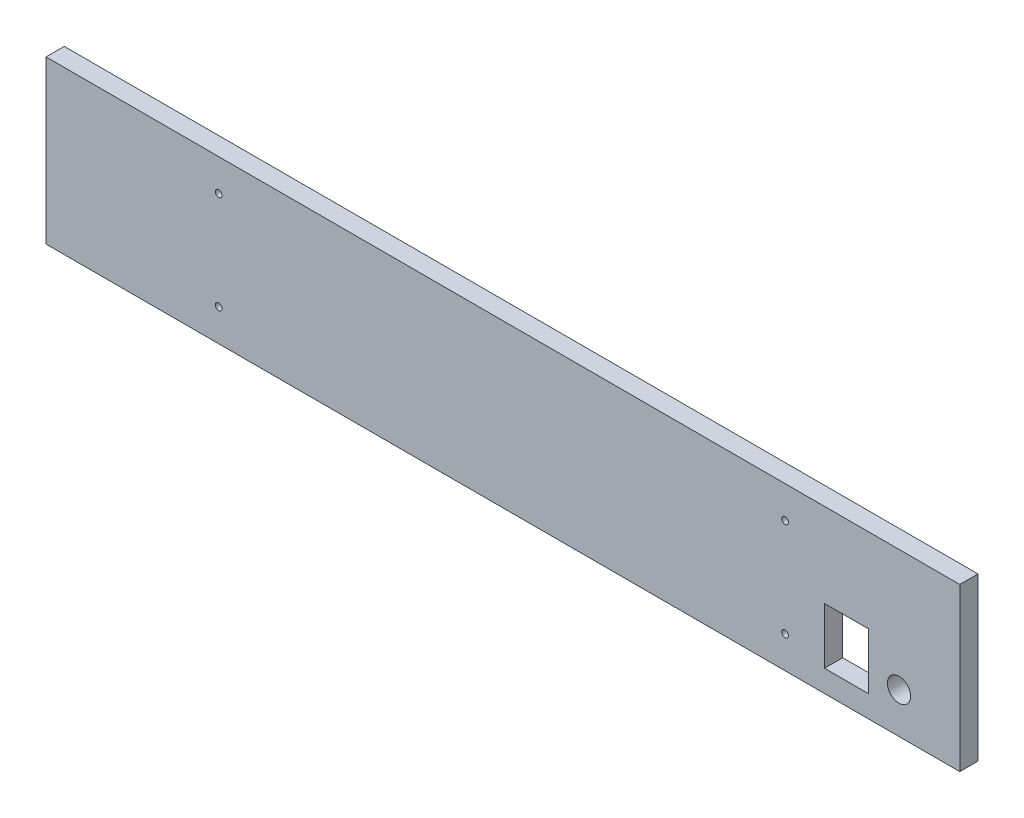
ISO-10303-21;
HEADER;
FILE_DESCRIPTION(('STEP AP214'),'2;1');
FILE_NAME('part.step','',(''),(''),'','','');
FILE_SCHEMA(('AUTOMOTIVE_DESIGN { 1 0 10303 214 1 1 1 1 }'));
ENDSEC;
DATA;
#1=APPLICATION_CONTEXT('core data for automotive mechanical design processes');
#2=APPLICATION_PROTOCOL_DEFINITION('international standard','automotive_design',2000,#1);
#3=PRODUCT_CONTEXT('',#1,'mechanical');
#4=PRODUCT('Part','Part','',(#3));
#5=PRODUCT_RELATED_PRODUCT_CATEGORY('part','',(#4));
#6=PRODUCT_DEFINITION_FORMATION('','',#4);
#7=PRODUCT_DEFINITION_CONTEXT('part definition',#1,'design');
#8=PRODUCT_DEFINITION('design','',#6,#7);
#9=PRODUCT_DEFINITION_SHAPE('','',#8);
#10=(LENGTH_UNIT() NAMED_UNIT(*) SI_UNIT(.MILLI.,.METRE.));
#11=(NAMED_UNIT(*) PLANE_ANGLE_UNIT() SI_UNIT($,.RADIAN.));
#12=(NAMED_UNIT(*) SI_UNIT($,.STERADIAN.) SOLID_ANGLE_UNIT());
#13=UNCERTAINTY_MEASURE_WITH_UNIT(LENGTH_MEASURE(1.E-05),#10,'distance_accuracy_value','');
#14=(GEOMETRIC_REPRESENTATION_CONTEXT(3) GLOBAL_UNCERTAINTY_ASSIGNED_CONTEXT((#13)) GLOBAL_UNIT_ASSIGNED_CONTEXT((#10,
#11,#12)) REPRESENTATION_CONTEXT('',''));
#15=CARTESIAN_POINT('',(0.,0.,0.));
#16=DIRECTION('',(0.,0.,1.));
#17=DIRECTION('',(1.,0.,0.));
#18=AXIS2_PLACEMENT_3D('',#15,#16,#17);
#19=CARTESIAN_POINT('',(0.,0.,-9.));
#20=DIRECTION('',(0.,0.,-1.));
#21=DIRECTION('',(-1.,0.,0.));
#22=AXIS2_PLACEMENT_3D('',#19,#20,#21);
#23=PLANE('',#22);
#24=CARTESIAN_POINT('',(85.22,15.79,-9.));
#25=DIRECTION('',(0.,0.,-1.));
#26=DIRECTION('',(-1.,0.,0.));
#27=AXIS2_PLACEMENT_3D('',#24,#25,#26);
#28=CIRCLE('',#27,1.65000000000002);
#29=CARTESIAN_POINT('',(83.57,15.79,-9.));
#30=VERTEX_POINT('',#29);
#31=EDGE_CURVE('E229',#30,#30,#28,.T.);
#32=ORIENTED_EDGE('',*,*,#31,.F.);
#33=EDGE_LOOP('',(#32));
#34=FACE_BOUND('',#33,.T.);
#35=CARTESIAN_POINT('',(85.22,64.21,-9.));
#36=DIRECTION('',(0.,0.,-1.));
#37=DIRECTION('',(-1.,0.,0.));
#38=AXIS2_PLACEMENT_3D('',#35,#36,#37);
#39=CIRCLE('',#38,1.65000000000002);
#40=CARTESIAN_POINT('',(83.57,64.21,-9.));
#41=VERTEX_POINT('',#40);
#42=EDGE_CURVE('E239',#41,#41,#39,.T.);
#43=ORIENTED_EDGE('',*,*,#42,.F.);
#44=EDGE_LOOP('',(#43));
#45=FACE_BOUND('',#44,.T.);
#46=CARTESIAN_POINT('',(364.78,15.79,-9.));
#47=DIRECTION('',(0.,0.,-1.));
#48=DIRECTION('',(-1.,0.,0.));
#49=AXIS2_PLACEMENT_3D('',#46,#47,#48);
#50=CIRCLE('',#49,1.64999999999999);
#51=CARTESIAN_POINT('',(363.13,15.79,-9.));
#52=VERTEX_POINT('',#51);
#53=EDGE_CURVE('E245',#52,#52,#50,.T.);
#54=ORIENTED_EDGE('',*,*,#53,.F.);
#55=EDGE_LOOP('',(#54));
#56=FACE_BOUND('',#55,.T.);
#57=CARTESIAN_POINT('',(364.78,64.21,-9.));
#58=DIRECTION('',(0.,0.,-1.));
#59=DIRECTION('',(-1.,0.,0.));
#60=AXIS2_PLACEMENT_3D('',#57,#58,#59);
#61=CIRCLE('',#60,1.64999999999999);
#62=CARTESIAN_POINT('',(363.13,64.21,-9.));
#63=VERTEX_POINT('',#62);
#64=EDGE_CURVE('E251',#63,#63,#61,.T.);
#65=ORIENTED_EDGE('',*,*,#64,.F.);
#66=EDGE_LOOP('',(#65));
#67=FACE_BOUND('',#66,.T.);
#68=CARTESIAN_POINT('',(421.,20.,-9.));
#69=DIRECTION('',(0.,0.,-1.));
#70=DIRECTION('',(-1.,0.,0.));
#71=AXIS2_PLACEMENT_3D('',#68,#69,#70);
#72=CIRCLE('',#71,5.74999999999998);
#73=CARTESIAN_POINT('',(415.25,20.,-9.));
#74=VERTEX_POINT('',#73);
#75=EDGE_CURVE('E257',#74,#74,#72,.T.);
#76=ORIENTED_EDGE('',*,*,#75,.F.);
#77=EDGE_LOOP('',(#76));
#78=FACE_BOUND('',#77,.T.);
#79=DIRECTION('',(0.,-1.,0.));
#80=VECTOR('',#79,1.);
#81=CARTESIAN_POINT('',(0.,0.,-9.));
#82=LINE('',#81,#80);
#83=CARTESIAN_POINT('',(0.,80.,-9.));
#84=VERTEX_POINT('',#83);
#85=CARTESIAN_POINT('',(0.,0.,-9.));
#86=VERTEX_POINT('',#85);
#87=EDGE_CURVE('E135',#84,#86,#82,.T.);
#88=ORIENTED_EDGE('',*,*,#87,.F.);
#89=DIRECTION('',(-1.,0.,0.));
#90=VECTOR('',#89,1.);
#91=CARTESIAN_POINT('',(0.,80.,-9.));
#92=LINE('',#91,#90);
#93=CARTESIAN_POINT('',(451.,80.,-9.));
#94=VERTEX_POINT('',#93);
#95=EDGE_CURVE('E145',#94,#84,#92,.T.);
#96=ORIENTED_EDGE('',*,*,#95,.F.);
#97=DIRECTION('',(0.,1.,0.));
#98=VECTOR('',#97,1.);
#99=CARTESIAN_POINT('',(451.,0.,-9.));
#100=LINE('',#99,#98);
#101=CARTESIAN_POINT('',(451.,0.,-9.));
#102=VERTEX_POINT('',#101);
#103=EDGE_CURVE('E142',#102,#94,#100,.T.);
#104=ORIENTED_EDGE('',*,*,#103,.F.);
#105=DIRECTION('',(1.,0.,0.));
#106=VECTOR('',#105,1.);
#107=CARTESIAN_POINT('',(0.,0.,-9.));
#108=LINE('',#107,#106);
#109=EDGE_CURVE('E138',#86,#102,#108,.T.);
#110=ORIENTED_EDGE('',*,*,#109,.F.);
#111=EDGE_LOOP('',(#88,#96,#104,#110));
#112=FACE_BOUND('',#111,.T.);
#113=DIRECTION('',(1.,0.,0.));
#114=VECTOR('',#113,1.);
#115=CARTESIAN_POINT('',(0.,38.49,-9.));
#116=LINE('',#115,#114);
#117=CARTESIAN_POINT('',(384.2,38.49,-9.));
#118=VERTEX_POINT('',#117);
#119=CARTESIAN_POINT('',(406.,38.49,-9.));
#120=VERTEX_POINT('',#119);
#121=EDGE_CURVE('E129',#118,#120,#116,.T.);
#122=ORIENTED_EDGE('',*,*,#121,.F.);
#123=DIRECTION('',(0.,-1.,0.));
#124=VECTOR('',#123,1.);
#125=CARTESIAN_POINT('',(384.2,0.,-9.));
#126=LINE('',#125,#124);
#127=CARTESIAN_POINT('',(384.2,10.79,-9.));
#128=VERTEX_POINT('',#127);
#129=EDGE_CURVE('E131',#118,#128,#126,.T.);
#130=ORIENTED_EDGE('',*,*,#129,.T.);
#131=DIRECTION('',(1.,0.,0.));
#132=VECTOR('',#131,1.);
#133=CARTESIAN_POINT('',(0.,10.79,-9.));
#134=LINE('',#133,#132);
#135=CARTESIAN_POINT('',(406.,10.79,-9.));
#136=VERTEX_POINT('',#135);
#137=EDGE_CURVE('E124',#128,#136,#134,.T.);
#138=ORIENTED_EDGE('',*,*,#137,.T.);
#139=DIRECTION('',(0.,-1.,0.));
#140=VECTOR('',#139,1.);
#141=CARTESIAN_POINT('',(406.,0.,-9.));
#142=LINE('',#141,#140);
#143=EDGE_CURVE('E105',#120,#136,#142,.T.);
#144=ORIENTED_EDGE('',*,*,#143,.F.);
#145=EDGE_LOOP('',(#122,#130,#138,#144));
#146=FACE_BOUND('',#145,.T.);
#147=ADVANCED_FACE('F33',(#34,#45,#56,#67,#78,#112,#146),#23,.T.);
#148=CARTESIAN_POINT('',(0.,0.,0.));
#149=DIRECTION('',(0.,0.,-1.));
#150=DIRECTION('',(-1.,0.,0.));
#151=AXIS2_PLACEMENT_3D('',#148,#149,#150);
#152=PLANE('',#151);
#153=CARTESIAN_POINT('',(85.22,15.79,0.));
#154=DIRECTION('',(0.,0.,1.));
#155=DIRECTION('',(1.,0.,0.));
#156=AXIS2_PLACEMENT_3D('',#153,#154,#155);
#157=CIRCLE('',#156,1.65000000000002);
#158=CARTESIAN_POINT('',(86.87,15.79,0.));
#159=VERTEX_POINT('',#158);
#160=EDGE_CURVE('E232',#159,#159,#157,.T.);
#161=ORIENTED_EDGE('',*,*,#160,.F.);
#162=EDGE_LOOP('',(#161));
#163=FACE_BOUND('',#162,.T.);
#164=CARTESIAN_POINT('',(85.22,64.21,0.));
#165=DIRECTION('',(0.,0.,1.));
#166=DIRECTION('',(1.,0.,0.));
#167=AXIS2_PLACEMENT_3D('',#164,#165,#166);
#168=CIRCLE('',#167,1.65000000000002);
#169=CARTESIAN_POINT('',(86.87,64.21,0.));
#170=VERTEX_POINT('',#169);
#171=EDGE_CURVE('E234',#170,#170,#168,.T.);
#172=ORIENTED_EDGE('',*,*,#171,.F.);
#173=EDGE_LOOP('',(#172));
#174=FACE_BOUND('',#173,.T.);
#175=CARTESIAN_POINT('',(364.78,15.79,0.));
#176=DIRECTION('',(0.,0.,1.));
#177=DIRECTION('',(1.,0.,0.));
#178=AXIS2_PLACEMENT_3D('',#175,#176,#177);
#179=CIRCLE('',#178,1.64999999999999);
#180=CARTESIAN_POINT('',(366.43,15.79,0.));
#181=VERTEX_POINT('',#180);
#182=EDGE_CURVE('E242',#181,#181,#179,.T.);
#183=ORIENTED_EDGE('',*,*,#182,.F.);
#184=EDGE_LOOP('',(#183));
#185=FACE_BOUND('',#184,.T.);
#186=CARTESIAN_POINT('',(364.78,64.21,0.));
#187=DIRECTION('',(0.,0.,1.));
#188=DIRECTION('',(1.,0.,0.));
#189=AXIS2_PLACEMENT_3D('',#186,#187,#188);
#190=CIRCLE('',#189,1.64999999999999);
#191=CARTESIAN_POINT('',(366.43,64.21,0.));
#192=VERTEX_POINT('',#191);
#193=EDGE_CURVE('E248',#192,#192,#190,.T.);
#194=ORIENTED_EDGE('',*,*,#193,.F.);
#195=EDGE_LOOP('',(#194));
#196=FACE_BOUND('',#195,.T.);
#197=CARTESIAN_POINT('',(421.,20.,0.));
#198=DIRECTION('',(0.,0.,1.));
#199=DIRECTION('',(1.,0.,0.));
#200=AXIS2_PLACEMENT_3D('',#197,#198,#199);
#201=CIRCLE('',#200,5.74999999999998);
#202=CARTESIAN_POINT('',(426.75,20.,0.));
#203=VERTEX_POINT('',#202);
#204=EDGE_CURVE('E254',#203,#203,#201,.T.);
#205=ORIENTED_EDGE('',*,*,#204,.F.);
#206=EDGE_LOOP('',(#205));
#207=FACE_BOUND('',#206,.T.);
#208=DIRECTION('',(0.,-1.,0.));
#209=VECTOR('',#208,1.);
#210=CARTESIAN_POINT('',(0.,0.,0.));
#211=LINE('',#210,#209);
#212=CARTESIAN_POINT('',(0.,80.,0.));
#213=VERTEX_POINT('',#212);
#214=CARTESIAN_POINT('',(0.,0.,0.));
#215=VERTEX_POINT('',#214);
#216=EDGE_CURVE('E134',#213,#215,#211,.T.);
#217=ORIENTED_EDGE('',*,*,#216,.T.);
#218=DIRECTION('',(1.,0.,0.));
#219=VECTOR('',#218,1.);
#220=CARTESIAN_POINT('',(0.,0.,0.));
#221=LINE('',#220,#219);
#222=CARTESIAN_POINT('',(451.,0.,0.));
#223=VERTEX_POINT('',#222);
#224=EDGE_CURVE('E150',#215,#223,#221,.T.);
#225=ORIENTED_EDGE('',*,*,#224,.T.);
#226=DIRECTION('',(0.,1.,0.));
#227=VECTOR('',#226,1.);
#228=CARTESIAN_POINT('',(451.,0.,0.));
#229=LINE('',#228,#227);
#230=CARTESIAN_POINT('',(451.,80.,0.));
#231=VERTEX_POINT('',#230);
#232=EDGE_CURVE('E153',#223,#231,#229,.T.);
#233=ORIENTED_EDGE('',*,*,#232,.T.);
#234=DIRECTION('',(-1.,0.,0.));
#235=VECTOR('',#234,1.);
#236=CARTESIAN_POINT('',(0.,80.,0.));
#237=LINE('',#236,#235);
#238=EDGE_CURVE('E139',#231,#213,#237,.T.);
#239=ORIENTED_EDGE('',*,*,#238,.T.);
#240=EDGE_LOOP('',(#217,#225,#233,#239));
#241=FACE_BOUND('',#240,.T.);
#242=DIRECTION('',(0.,1.,0.));
#243=VECTOR('',#242,1.);
#244=CARTESIAN_POINT('',(384.2,0.,0.));
#245=LINE('',#244,#243);
#246=CARTESIAN_POINT('',(384.2,10.79,0.));
#247=VERTEX_POINT('',#246);
#248=CARTESIAN_POINT('',(384.2,38.49,0.));
#249=VERTEX_POINT('',#248);
#250=EDGE_CURVE('E58',#247,#249,#245,.T.);
#251=ORIENTED_EDGE('',*,*,#250,.T.);
#252=DIRECTION('',(-1.,0.,0.));
#253=VECTOR('',#252,1.);
#254=CARTESIAN_POINT('',(0.,38.49,0.));
#255=LINE('',#254,#253);
#256=CARTESIAN_POINT('',(406.,38.49,0.));
#257=VERTEX_POINT('',#256);
#258=EDGE_CURVE('E117',#257,#249,#255,.T.);
#259=ORIENTED_EDGE('',*,*,#258,.F.);
#260=DIRECTION('',(0.,1.,0.));
#261=VECTOR('',#260,1.);
#262=CARTESIAN_POINT('',(406.,0.,0.));
#263=LINE('',#262,#261);
#264=CARTESIAN_POINT('',(406.,10.79,0.));
#265=VERTEX_POINT('',#264);
#266=EDGE_CURVE('E102',#265,#257,#263,.T.);
#267=ORIENTED_EDGE('',*,*,#266,.F.);
#268=DIRECTION('',(-1.,0.,0.));
#269=VECTOR('',#268,1.);
#270=CARTESIAN_POINT('',(0.,10.79,0.));
#271=LINE('',#270,#269);
#272=EDGE_CURVE('E111',#265,#247,#271,.T.);
#273=ORIENTED_EDGE('',*,*,#272,.T.);
#274=EDGE_LOOP('',(#251,#259,#267,#273));
#275=FACE_BOUND('',#274,.T.);
#276=ADVANCED_FACE('F115',(#163,#174,#185,#196,#207,#241,#275),#152,.F.);
#277=CARTESIAN_POINT('',(0.,0.,-9.));
#278=DIRECTION('',(-1.,0.,0.));
#279=DIRECTION('',(0.,0.,1.));
#280=AXIS2_PLACEMENT_3D('',#277,#278,#279);
#281=PLANE('',#280);
#282=ORIENTED_EDGE('',*,*,#216,.F.);
#283=DIRECTION('',(0.,0.,1.));
#284=VECTOR('',#283,1.);
#285=CARTESIAN_POINT('',(0.,80.,-9.));
#286=LINE('',#285,#284);
#287=EDGE_CURVE('E11',#84,#213,#286,.T.);
#288=ORIENTED_EDGE('',*,*,#287,.F.);
#289=ORIENTED_EDGE('',*,*,#87,.T.);
#290=DIRECTION('',(0.,0.,1.));
#291=VECTOR('',#290,1.);
#292=CARTESIAN_POINT('',(0.,0.,-9.));
#293=LINE('',#292,#291);
#294=EDGE_CURVE('E37',#86,#215,#293,.T.);
#295=ORIENTED_EDGE('',*,*,#294,.T.);
#296=EDGE_LOOP('',(#282,#288,#289,#295));
#297=FACE_BOUND('',#296,.T.);
#298=ADVANCED_FACE('F35',(#297),#281,.T.);
#299=CARTESIAN_POINT('',(0.,80.,-9.));
#300=DIRECTION('',(0.,1.,0.));
#301=DIRECTION('',(0.,0.,1.));
#302=AXIS2_PLACEMENT_3D('',#299,#300,#301);
#303=PLANE('',#302);
#304=ORIENTED_EDGE('',*,*,#238,.F.);
#305=DIRECTION('',(0.,0.,1.));
#306=VECTOR('',#305,1.);
#307=CARTESIAN_POINT('',(451.,80.,-9.));
#308=LINE('',#307,#306);
#309=EDGE_CURVE('E42',#94,#231,#308,.T.);
#310=ORIENTED_EDGE('',*,*,#309,.F.);
#311=ORIENTED_EDGE('',*,*,#95,.T.);
#312=ORIENTED_EDGE('',*,*,#287,.T.);
#313=EDGE_LOOP('',(#304,#310,#311,#312));
#314=FACE_BOUND('',#313,.T.);
#315=ADVANCED_FACE('F170',(#314),#303,.T.);
#316=CARTESIAN_POINT('',(451.,0.,-9.));
#317=DIRECTION('',(1.,0.,0.));
#318=DIRECTION('',(0.,0.,-1.));
#319=AXIS2_PLACEMENT_3D('',#316,#317,#318);
#320=PLANE('',#319);
#321=ORIENTED_EDGE('',*,*,#232,.F.);
#322=DIRECTION('',(0.,0.,1.));
#323=VECTOR('',#322,1.);
#324=CARTESIAN_POINT('',(451.,0.,-9.));
#325=LINE('',#324,#323);
#326=EDGE_CURVE('E158',#102,#223,#325,.T.);
#327=ORIENTED_EDGE('',*,*,#326,.F.);
#328=ORIENTED_EDGE('',*,*,#103,.T.);
#329=ORIENTED_EDGE('',*,*,#309,.T.);
#330=EDGE_LOOP('',(#321,#327,#328,#329));
#331=FACE_BOUND('',#330,.T.);
#332=ADVANCED_FACE('F176',(#331),#320,.T.);
#333=CARTESIAN_POINT('',(0.,0.,-9.));
#334=DIRECTION('',(0.,-1.,0.));
#335=DIRECTION('',(0.,0.,-1.));
#336=AXIS2_PLACEMENT_3D('',#333,#334,#335);
#337=PLANE('',#336);
#338=ORIENTED_EDGE('',*,*,#224,.F.);
#339=ORIENTED_EDGE('',*,*,#294,.F.);
#340=ORIENTED_EDGE('',*,*,#109,.T.);
#341=ORIENTED_EDGE('',*,*,#326,.T.);
#342=EDGE_LOOP('',(#338,#339,#340,#341));
#343=FACE_BOUND('',#342,.T.);
#344=ADVANCED_FACE('F166',(#343),#337,.T.);
#345=CARTESIAN_POINT('',(384.2,0.,-10.));
#346=DIRECTION('',(1.,0.,0.));
#347=DIRECTION('',(0.,0.,-1.));
#348=AXIS2_PLACEMENT_3D('',#345,#346,#347);
#349=PLANE('',#348);
#350=DIRECTION('',(0.,0.,1.));
#351=VECTOR('',#350,1.);
#352=CARTESIAN_POINT('',(384.2,38.49,-10.));
#353=LINE('',#352,#351);
#354=EDGE_CURVE('E122',#118,#249,#353,.T.);
#355=ORIENTED_EDGE('',*,*,#354,.T.);
#356=ORIENTED_EDGE('',*,*,#250,.F.);
#357=DIRECTION('',(0.,0.,1.));
#358=VECTOR('',#357,1.);
#359=CARTESIAN_POINT('',(384.2,10.79,-10.));
#360=LINE('',#359,#358);
#361=EDGE_CURVE('E108',#128,#247,#360,.T.);
#362=ORIENTED_EDGE('',*,*,#361,.F.);
#363=ORIENTED_EDGE('',*,*,#129,.F.);
#364=EDGE_LOOP('',(#355,#356,#362,#363));
#365=FACE_BOUND('',#364,.T.);
#366=ADVANCED_FACE('F183',(#365),#349,.T.);
#367=CARTESIAN_POINT('',(0.,38.49,-10.));
#368=DIRECTION('',(0.,1.,0.));
#369=DIRECTION('',(0.,0.,1.));
#370=AXIS2_PLACEMENT_3D('',#367,#368,#369);
#371=PLANE('',#370);
#372=ORIENTED_EDGE('',*,*,#121,.T.);
#373=DIRECTION('',(0.,0.,1.));
#374=VECTOR('',#373,1.);
#375=CARTESIAN_POINT('',(406.,38.49,-10.));
#376=LINE('',#375,#374);
#377=EDGE_CURVE('E107',#120,#257,#376,.T.);
#378=ORIENTED_EDGE('',*,*,#377,.T.);
#379=ORIENTED_EDGE('',*,*,#258,.T.);
#380=ORIENTED_EDGE('',*,*,#354,.F.);
#381=EDGE_LOOP('',(#372,#378,#379,#380));
#382=FACE_BOUND('',#381,.T.);
#383=ADVANCED_FACE('F198',(#382),#371,.F.);
#384=CARTESIAN_POINT('',(406.,0.,-10.));
#385=DIRECTION('',(1.,0.,0.));
#386=DIRECTION('',(0.,0.,-1.));
#387=AXIS2_PLACEMENT_3D('',#384,#385,#386);
#388=PLANE('',#387);
#389=ORIENTED_EDGE('',*,*,#143,.T.);
#390=DIRECTION('',(0.,0.,1.));
#391=VECTOR('',#390,1.);
#392=CARTESIAN_POINT('',(406.,10.79,-10.));
#393=LINE('',#392,#391);
#394=EDGE_CURVE('E50',#136,#265,#393,.T.);
#395=ORIENTED_EDGE('',*,*,#394,.T.);
#396=ORIENTED_EDGE('',*,*,#266,.T.);
#397=ORIENTED_EDGE('',*,*,#377,.F.);
#398=EDGE_LOOP('',(#389,#395,#396,#397));
#399=FACE_BOUND('',#398,.T.);
#400=ADVANCED_FACE('F99',(#399),#388,.F.);
#401=CARTESIAN_POINT('',(0.,10.79,-10.));
#402=DIRECTION('',(0.,1.,0.));
#403=DIRECTION('',(-1.,0.,0.));
#404=AXIS2_PLACEMENT_3D('',#401,#402,#403);
#405=PLANE('',#404);
#406=ORIENTED_EDGE('',*,*,#361,.T.);
#407=ORIENTED_EDGE('',*,*,#272,.F.);
#408=ORIENTED_EDGE('',*,*,#394,.F.);
#409=ORIENTED_EDGE('',*,*,#137,.F.);
#410=EDGE_LOOP('',(#406,#407,#408,#409));
#411=FACE_BOUND('',#410,.T.);
#412=ADVANCED_FACE('F112',(#411),#405,.T.);
#413=CARTESIAN_POINT('',(421.,20.,-10.));
#414=DIRECTION('',(0.,0.,1.));
#415=DIRECTION('',(1.,0.,0.));
#416=AXIS2_PLACEMENT_3D('',#413,#414,#415);
#417=CYLINDRICAL_SURFACE('',#416,5.74999999999998);
#418=ORIENTED_EDGE('',*,*,#75,.T.);
#419=EDGE_LOOP('',(#418));
#420=FACE_BOUND('',#419,.T.);
#421=ORIENTED_EDGE('',*,*,#204,.T.);
#422=EDGE_LOOP('',(#421));
#423=FACE_BOUND('',#422,.T.);
#424=ADVANCED_FACE('F201',(#420,#423),#417,.F.);
#425=CARTESIAN_POINT('',(364.78,64.21,-10.));
#426=DIRECTION('',(0.,0.,1.));
#427=DIRECTION('',(1.,0.,0.));
#428=AXIS2_PLACEMENT_3D('',#425,#426,#427);
#429=CYLINDRICAL_SURFACE('',#428,1.64999999999999);
#430=ORIENTED_EDGE('',*,*,#64,.T.);
#431=EDGE_LOOP('',(#430));
#432=FACE_BOUND('',#431,.T.);
#433=ORIENTED_EDGE('',*,*,#193,.T.);
#434=EDGE_LOOP('',(#433));
#435=FACE_BOUND('',#434,.T.);
#436=ADVANCED_FACE('F209',(#432,#435),#429,.F.);
#437=CARTESIAN_POINT('',(364.78,15.79,-10.));
#438=DIRECTION('',(0.,0.,1.));
#439=DIRECTION('',(1.,0.,0.));
#440=AXIS2_PLACEMENT_3D('',#437,#438,#439);
#441=CYLINDRICAL_SURFACE('',#440,1.64999999999999);
#442=ORIENTED_EDGE('',*,*,#53,.T.);
#443=EDGE_LOOP('',(#442));
#444=FACE_BOUND('',#443,.T.);
#445=ORIENTED_EDGE('',*,*,#182,.T.);
#446=EDGE_LOOP('',(#445));
#447=FACE_BOUND('',#446,.T.);
#448=ADVANCED_FACE('F213',(#444,#447),#441,.F.);
#449=CARTESIAN_POINT('',(85.22,64.21,-10.));
#450=DIRECTION('',(0.,0.,1.));
#451=DIRECTION('',(1.,0.,0.));
#452=AXIS2_PLACEMENT_3D('',#449,#450,#451);
#453=CYLINDRICAL_SURFACE('',#452,1.65000000000002);
#454=ORIENTED_EDGE('',*,*,#42,.T.);
#455=EDGE_LOOP('',(#454));
#456=FACE_BOUND('',#455,.T.);
#457=ORIENTED_EDGE('',*,*,#171,.T.);
#458=EDGE_LOOP('',(#457));
#459=FACE_BOUND('',#458,.T.);
#460=ADVANCED_FACE('F217',(#456,#459),#453,.F.);
#461=CARTESIAN_POINT('',(85.22,15.79,-10.));
#462=DIRECTION('',(0.,0.,1.));
#463=DIRECTION('',(1.,0.,0.));
#464=AXIS2_PLACEMENT_3D('',#461,#462,#463);
#465=CYLINDRICAL_SURFACE('',#464,1.65000000000002);
#466=ORIENTED_EDGE('',*,*,#31,.T.);
#467=EDGE_LOOP('',(#466));
#468=FACE_BOUND('',#467,.T.);
#469=ORIENTED_EDGE('',*,*,#160,.T.);
#470=EDGE_LOOP('',(#469));
#471=FACE_BOUND('',#470,.T.);
#472=ADVANCED_FACE('F221',(#468,#471),#465,.F.);
#473=CLOSED_SHELL('',(#147,#276,#298,#315,#332,#344,#366,#383,#400,#412,#424,#436,#448,#460,#472));
#474=MANIFOLD_SOLID_BREP('B2',#473);
#475=ADVANCED_BREP_SHAPE_REPRESENTATION('',(#18,#474),#14);
#476=SHAPE_DEFINITION_REPRESENTATION(#9,#475);
ENDSEC;
END-ISO-10303-21;
